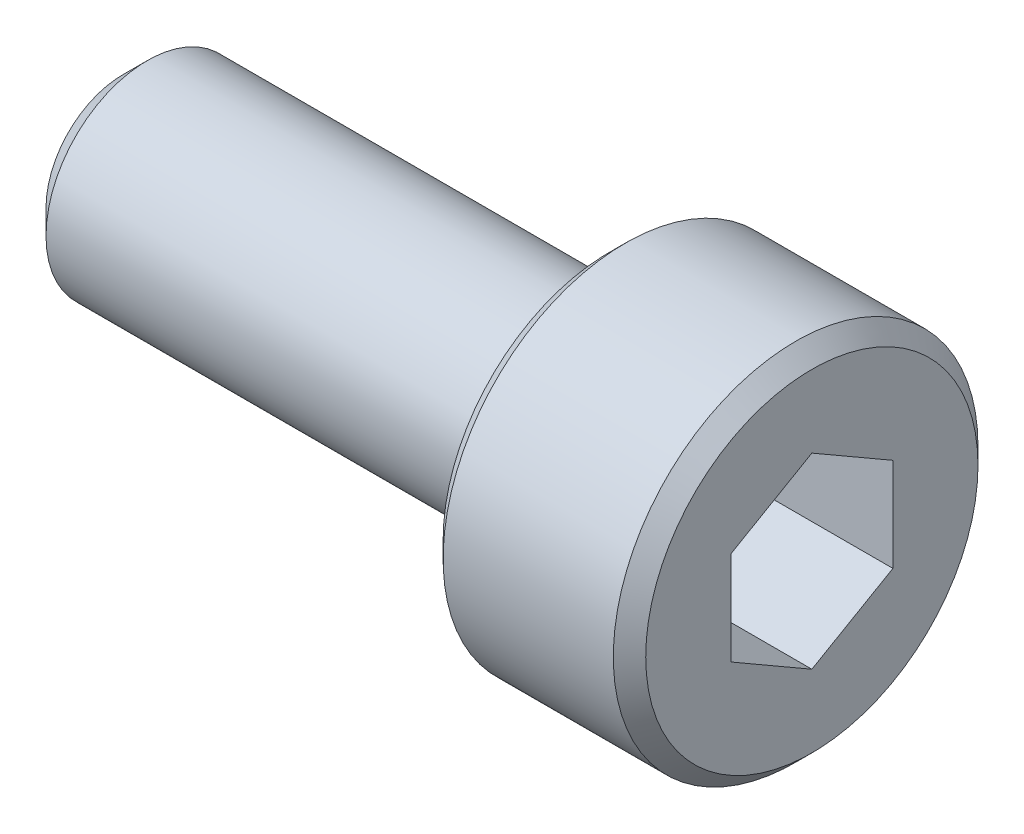
ISO-10303-21;
HEADER;
FILE_DESCRIPTION(('STEP AP214'),'2;1');
FILE_NAME('part.step','',(''),(''),'','','');
FILE_SCHEMA(('AUTOMOTIVE_DESIGN { 1 0 10303 214 1 1 1 1 }'));
ENDSEC;
DATA;
#1=APPLICATION_CONTEXT('core data for automotive mechanical design processes');
#2=APPLICATION_PROTOCOL_DEFINITION('international standard','automotive_design',2000,#1);
#3=PRODUCT_CONTEXT('',#1,'mechanical');
#4=PRODUCT('Part','Part','',(#3));
#5=PRODUCT_RELATED_PRODUCT_CATEGORY('part','',(#4));
#6=PRODUCT_DEFINITION_FORMATION('','',#4);
#7=PRODUCT_DEFINITION_CONTEXT('part definition',#1,'design');
#8=PRODUCT_DEFINITION('design','',#6,#7);
#9=PRODUCT_DEFINITION_SHAPE('','',#8);
#10=(LENGTH_UNIT() NAMED_UNIT(*) SI_UNIT(.MILLI.,.METRE.));
#11=(NAMED_UNIT(*) PLANE_ANGLE_UNIT() SI_UNIT($,.RADIAN.));
#12=(NAMED_UNIT(*) SI_UNIT($,.STERADIAN.) SOLID_ANGLE_UNIT());
#13=UNCERTAINTY_MEASURE_WITH_UNIT(LENGTH_MEASURE(1.E-05),#10,'distance_accuracy_value','');
#14=(GEOMETRIC_REPRESENTATION_CONTEXT(3) GLOBAL_UNCERTAINTY_ASSIGNED_CONTEXT((#13)) GLOBAL_UNIT_ASSIGNED_CONTEXT((#10,
#11,#12)) REPRESENTATION_CONTEXT('',''));
#15=CARTESIAN_POINT('',(0.,0.,0.));
#16=DIRECTION('',(0.,0.,1.));
#17=DIRECTION('',(1.,0.,0.));
#18=AXIS2_PLACEMENT_3D('',#15,#16,#17);
#19=CARTESIAN_POINT('',(0.,0.,1.25));
#20=DIRECTION('',(1.,0.,0.));
#21=DIRECTION('',(0.,0.,-1.));
#22=AXIS2_PLACEMENT_3D('',#19,#20,#21);
#23=CYLINDRICAL_SURFACE('',#22,1.25);
#24=CARTESIAN_POINT('',(-5.7,0.,1.25));
#25=DIRECTION('',(-1.,0.,0.));
#26=DIRECTION('',(0.,0.,1.));
#27=AXIS2_PLACEMENT_3D('',#24,#25,#26);
#28=CIRCLE('',#27,1.25);
#29=CARTESIAN_POINT('',(-5.7,0.,2.5));
#30=VERTEX_POINT('',#29);
#31=EDGE_CURVE('E42',#30,#30,#28,.F.);
#32=ORIENTED_EDGE('',*,*,#31,.T.);
#33=EDGE_LOOP('',(#32));
#34=FACE_BOUND('',#33,.T.);
#35=CARTESIAN_POINT('',(0.,0.,1.25));
#36=DIRECTION('',(1.,0.,0.));
#37=DIRECTION('',(0.,0.,-1.));
#38=AXIS2_PLACEMENT_3D('',#35,#36,#37);
#39=CIRCLE('',#38,1.25);
#40=CARTESIAN_POINT('',(0.,0.,0.));
#41=VERTEX_POINT('',#40);
#42=EDGE_CURVE('E136',#41,#41,#39,.T.);
#43=ORIENTED_EDGE('',*,*,#42,.F.);
#44=EDGE_LOOP('',(#43));
#45=FACE_BOUND('',#44,.T.);
#46=ADVANCED_FACE('F34',(#34,#45),#23,.T.);
#47=CARTESIAN_POINT('',(-6.,0.,0.));
#48=DIRECTION('',(-1.,0.,0.));
#49=DIRECTION('',(0.,0.,1.));
#50=AXIS2_PLACEMENT_3D('',#47,#48,#49);
#51=PLANE('',#50);
#52=CARTESIAN_POINT('',(-6.,0.,1.25));
#53=DIRECTION('',(-1.,0.,0.));
#54=DIRECTION('',(0.,0.,1.));
#55=AXIS2_PLACEMENT_3D('',#52,#53,#54);
#56=CIRCLE('',#55,0.950000000000001);
#57=CARTESIAN_POINT('',(-6.,0.,2.2));
#58=VERTEX_POINT('',#57);
#59=EDGE_CURVE('E11',#58,#58,#56,.T.);
#60=ORIENTED_EDGE('',*,*,#59,.T.);
#61=EDGE_LOOP('',(#60));
#62=FACE_BOUND('',#61,.T.);
#63=ADVANCED_FACE('F170',(#62),#51,.T.);
#64=CARTESIAN_POINT('',(2.5,0.,0.));
#65=DIRECTION('',(1.,0.,0.));
#66=DIRECTION('',(0.,0.,-1.));
#67=AXIS2_PLACEMENT_3D('',#64,#65,#66);
#68=PLANE('',#67);
#69=CARTESIAN_POINT('',(2.5,0.,1.25));
#70=DIRECTION('',(1.,0.,0.));
#71=DIRECTION('',(0.,0.,-1.));
#72=AXIS2_PLACEMENT_3D('',#69,#70,#71);
#73=CIRCLE('',#72,2.05);
#74=CARTESIAN_POINT('',(2.5,0.,-0.799999999999998));
#75=VERTEX_POINT('',#74);
#76=EDGE_CURVE('E153',#75,#75,#73,.T.);
#77=ORIENTED_EDGE('',*,*,#76,.T.);
#78=EDGE_LOOP('',(#77));
#79=FACE_BOUND('',#78,.T.);
#80=DIRECTION('',(0.,0.5,0.866025403784439));
#81=VECTOR('',#80,1.);
#82=CARTESIAN_POINT('',(2.5,0.577350269189626,0.25));
#83=LINE('',#82,#81);
#84=CARTESIAN_POINT('',(2.5,0.577350269189626,0.25));
#85=VERTEX_POINT('',#84);
#86=CARTESIAN_POINT('',(2.5,1.15470053837925,1.25));
#87=VERTEX_POINT('',#86);
#88=EDGE_CURVE('E49',#85,#87,#83,.T.);
#89=ORIENTED_EDGE('',*,*,#88,.F.);
#90=DIRECTION('',(0.,1.,0.));
#91=VECTOR('',#90,1.);
#92=CARTESIAN_POINT('',(2.5,-0.577350269189626,0.25));
#93=LINE('',#92,#91);
#94=CARTESIAN_POINT('',(2.5,-0.577350269189626,0.25));
#95=VERTEX_POINT('',#94);
#96=EDGE_CURVE('E132',#95,#85,#93,.T.);
#97=ORIENTED_EDGE('',*,*,#96,.F.);
#98=DIRECTION('',(0.,0.5,-0.866025403784439));
#99=VECTOR('',#98,1.);
#100=CARTESIAN_POINT('',(2.5,-1.15470053837925,1.25));
#101=LINE('',#100,#99);
#102=CARTESIAN_POINT('',(2.5,-1.15470053837925,1.25));
#103=VERTEX_POINT('',#102);
#104=EDGE_CURVE('E130',#103,#95,#101,.T.);
#105=ORIENTED_EDGE('',*,*,#104,.F.);
#106=DIRECTION('',(0.,-0.5,-0.866025403784439));
#107=VECTOR('',#106,1.);
#108=CARTESIAN_POINT('',(2.5,-0.577350269189626,2.25));
#109=LINE('',#108,#107);
#110=CARTESIAN_POINT('',(2.5,-0.577350269189626,2.25));
#111=VERTEX_POINT('',#110);
#112=EDGE_CURVE('E97',#111,#103,#109,.T.);
#113=ORIENTED_EDGE('',*,*,#112,.F.);
#114=DIRECTION('',(0.,-1.,0.));
#115=VECTOR('',#114,1.);
#116=CARTESIAN_POINT('',(2.5,0.577350269189626,2.25));
#117=LINE('',#116,#115);
#118=CARTESIAN_POINT('',(2.5,0.577350269189626,2.25));
#119=VERTEX_POINT('',#118);
#120=EDGE_CURVE('E126',#119,#111,#117,.T.);
#121=ORIENTED_EDGE('',*,*,#120,.F.);
#122=DIRECTION('',(0.,-0.5,0.866025403784439));
#123=VECTOR('',#122,1.);
#124=CARTESIAN_POINT('',(2.5,1.15470053837925,1.25));
#125=LINE('',#124,#123);
#126=EDGE_CURVE('E123',#87,#119,#125,.T.);
#127=ORIENTED_EDGE('',*,*,#126,.F.);
#128=EDGE_LOOP('',(#89,#97,#105,#113,#121,#127));
#129=FACE_BOUND('',#128,.T.);
#130=ADVANCED_FACE('F175',(#79,#129),#68,.T.);
#131=CARTESIAN_POINT('',(0.,0.,1.25));
#132=DIRECTION('',(1.,0.,0.));
#133=DIRECTION('',(0.,0.,-1.));
#134=AXIS2_PLACEMENT_3D('',#131,#132,#133);
#135=CYLINDRICAL_SURFACE('',#134,2.25);
#136=CARTESIAN_POINT('',(0.2,0.,1.25));
#137=DIRECTION('',(1.,0.,0.));
#138=DIRECTION('',(0.,0.,-1.));
#139=AXIS2_PLACEMENT_3D('',#136,#137,#138);
#140=CIRCLE('',#139,2.25);
#141=CARTESIAN_POINT('',(0.2,0.,-1.));
#142=VERTEX_POINT('',#141);
#143=EDGE_CURVE('E147',#142,#142,#140,.T.);
#144=ORIENTED_EDGE('',*,*,#143,.T.);
#145=EDGE_LOOP('',(#144));
#146=FACE_BOUND('',#145,.T.);
#147=CARTESIAN_POINT('',(2.3,0.,1.25));
#148=DIRECTION('',(1.,0.,0.));
#149=DIRECTION('',(0.,0.,-1.));
#150=AXIS2_PLACEMENT_3D('',#147,#148,#149);
#151=CIRCLE('',#150,2.25);
#152=CARTESIAN_POINT('',(2.3,0.,-1.));
#153=VERTEX_POINT('',#152);
#154=EDGE_CURVE('E144',#153,#153,#151,.F.);
#155=ORIENTED_EDGE('',*,*,#154,.T.);
#156=EDGE_LOOP('',(#155));
#157=FACE_BOUND('',#156,.T.);
#158=ADVANCED_FACE('F191',(#146,#157),#135,.T.);
#159=CARTESIAN_POINT('',(0.,0.,0.));
#160=DIRECTION('',(1.,0.,0.));
#161=DIRECTION('',(0.,0.,-1.));
#162=AXIS2_PLACEMENT_3D('',#159,#160,#161);
#163=PLANE('',#162);
#164=CARTESIAN_POINT('',(0.,0.,1.25));
#165=DIRECTION('',(1.,0.,0.));
#166=DIRECTION('',(0.,0.,-1.));
#167=AXIS2_PLACEMENT_3D('',#164,#165,#166);
#168=CIRCLE('',#167,2.05);
#169=CARTESIAN_POINT('',(0.,0.,-0.8));
#170=VERTEX_POINT('',#169);
#171=EDGE_CURVE('E150',#170,#170,#168,.F.);
#172=ORIENTED_EDGE('',*,*,#171,.T.);
#173=EDGE_LOOP('',(#172));
#174=FACE_BOUND('',#173,.T.);
#175=ORIENTED_EDGE('',*,*,#42,.T.);
#176=EDGE_LOOP('',(#175));
#177=FACE_BOUND('',#176,.T.);
#178=ADVANCED_FACE('F194',(#174,#177),#163,.F.);
#179=CARTESIAN_POINT('',(0.5,0.577350269189626,0.250000000000001));
#180=DIRECTION('',(0.,0.866025403784439,-0.5));
#181=DIRECTION('',(0.,0.5,0.866025403784439));
#182=AXIS2_PLACEMENT_3D('',#179,#180,#181);
#183=PLANE('',#182);
#184=ORIENTED_EDGE('',*,*,#88,.T.);
#185=DIRECTION('',(1.,0.,0.));
#186=VECTOR('',#185,1.);
#187=CARTESIAN_POINT('',(0.5,1.15470053837925,1.25));
#188=LINE('',#187,#186);
#189=CARTESIAN_POINT('',(0.5,1.15470053837925,1.25));
#190=VERTEX_POINT('',#189);
#191=EDGE_CURVE('E79',#190,#87,#188,.T.);
#192=ORIENTED_EDGE('',*,*,#191,.F.);
#193=DIRECTION('',(0.,0.5,0.866025403784439));
#194=VECTOR('',#193,1.);
#195=CARTESIAN_POINT('',(0.5,0.577350269189626,0.250000000000001));
#196=LINE('',#195,#194);
#197=CARTESIAN_POINT('',(0.5,0.577350269189626,0.250000000000001));
#198=VERTEX_POINT('',#197);
#199=EDGE_CURVE('E134',#198,#190,#196,.T.);
#200=ORIENTED_EDGE('',*,*,#199,.F.);
#201=DIRECTION('',(1.,0.,0.));
#202=VECTOR('',#201,1.);
#203=CARTESIAN_POINT('',(0.5,0.577350269189626,0.250000000000001));
#204=LINE('',#203,#202);
#205=EDGE_CURVE('E57',#198,#85,#204,.T.);
#206=ORIENTED_EDGE('',*,*,#205,.T.);
#207=EDGE_LOOP('',(#184,#192,#200,#206));
#208=FACE_BOUND('',#207,.T.);
#209=ADVANCED_FACE('F207',(#208),#183,.F.);
#210=CARTESIAN_POINT('',(0.5,-0.577350269189626,0.25));
#211=DIRECTION('',(0.,0.,-1.));
#212=DIRECTION('',(0.,1.,0.));
#213=AXIS2_PLACEMENT_3D('',#210,#211,#212);
#214=PLANE('',#213);
#215=ORIENTED_EDGE('',*,*,#96,.T.);
#216=ORIENTED_EDGE('',*,*,#205,.F.);
#217=DIRECTION('',(0.,1.,0.));
#218=VECTOR('',#217,1.);
#219=CARTESIAN_POINT('',(0.5,-0.577350269189626,0.25));
#220=LINE('',#219,#218);
#221=CARTESIAN_POINT('',(0.5,-0.577350269189626,0.25));
#222=VERTEX_POINT('',#221);
#223=EDGE_CURVE('E109',#222,#198,#220,.T.);
#224=ORIENTED_EDGE('',*,*,#223,.F.);
#225=DIRECTION('',(1.,0.,0.));
#226=VECTOR('',#225,1.);
#227=CARTESIAN_POINT('',(0.5,-0.577350269189626,0.25));
#228=LINE('',#227,#226);
#229=EDGE_CURVE('E101',#222,#95,#228,.T.);
#230=ORIENTED_EDGE('',*,*,#229,.T.);
#231=EDGE_LOOP('',(#215,#216,#224,#230));
#232=FACE_BOUND('',#231,.T.);
#233=ADVANCED_FACE('F209',(#232),#214,.F.);
#234=CARTESIAN_POINT('',(0.5,-1.15470053837925,1.25));
#235=DIRECTION('',(0.,-0.866025403784439,-0.5));
#236=DIRECTION('',(0.,0.5,-0.866025403784439));
#237=AXIS2_PLACEMENT_3D('',#234,#235,#236);
#238=PLANE('',#237);
#239=ORIENTED_EDGE('',*,*,#104,.T.);
#240=ORIENTED_EDGE('',*,*,#229,.F.);
#241=DIRECTION('',(0.,0.5,-0.866025403784439));
#242=VECTOR('',#241,1.);
#243=CARTESIAN_POINT('',(0.5,-1.15470053837925,1.25));
#244=LINE('',#243,#242);
#245=CARTESIAN_POINT('',(0.5,-1.15470053837925,1.25));
#246=VERTEX_POINT('',#245);
#247=EDGE_CURVE('E105',#246,#222,#244,.T.);
#248=ORIENTED_EDGE('',*,*,#247,.F.);
#249=DIRECTION('',(1.,0.,0.));
#250=VECTOR('',#249,1.);
#251=CARTESIAN_POINT('',(0.5,-1.15470053837925,1.25));
#252=LINE('',#251,#250);
#253=EDGE_CURVE('E90',#246,#103,#252,.T.);
#254=ORIENTED_EDGE('',*,*,#253,.T.);
#255=EDGE_LOOP('',(#239,#240,#248,#254));
#256=FACE_BOUND('',#255,.T.);
#257=ADVANCED_FACE('F106',(#256),#238,.F.);
#258=CARTESIAN_POINT('',(0.500000000000001,-0.577350269189626,2.25));
#259=DIRECTION('',(0.,-0.866025403784439,0.5));
#260=DIRECTION('',(0.,-0.5,-0.866025403784439));
#261=AXIS2_PLACEMENT_3D('',#258,#259,#260);
#262=PLANE('',#261);
#263=ORIENTED_EDGE('',*,*,#112,.T.);
#264=ORIENTED_EDGE('',*,*,#253,.F.);
#265=DIRECTION('',(0.,-0.5,-0.866025403784439));
#266=VECTOR('',#265,1.);
#267=CARTESIAN_POINT('',(0.500000000000001,-0.577350269189626,2.25));
#268=LINE('',#267,#266);
#269=CARTESIAN_POINT('',(0.500000000000001,-0.577350269189626,2.25));
#270=VERTEX_POINT('',#269);
#271=EDGE_CURVE('E94',#270,#246,#268,.T.);
#272=ORIENTED_EDGE('',*,*,#271,.F.);
#273=DIRECTION('',(1.,0.,0.));
#274=VECTOR('',#273,1.);
#275=CARTESIAN_POINT('',(0.500000000000001,-0.577350269189626,2.25));
#276=LINE('',#275,#274);
#277=EDGE_CURVE('E102',#270,#111,#276,.T.);
#278=ORIENTED_EDGE('',*,*,#277,.T.);
#279=EDGE_LOOP('',(#263,#264,#272,#278));
#280=FACE_BOUND('',#279,.T.);
#281=ADVANCED_FACE('F92',(#280),#262,.F.);
#282=CARTESIAN_POINT('',(0.500000000000001,0.577350269189626,2.25));
#283=DIRECTION('',(0.,0.,1.));
#284=DIRECTION('',(1.,0.,0.));
#285=AXIS2_PLACEMENT_3D('',#282,#283,#284);
#286=PLANE('',#285);
#287=ORIENTED_EDGE('',*,*,#120,.T.);
#288=ORIENTED_EDGE('',*,*,#277,.F.);
#289=DIRECTION('',(0.,-1.,0.));
#290=VECTOR('',#289,1.);
#291=CARTESIAN_POINT('',(0.500000000000001,0.577350269189626,2.25));
#292=LINE('',#291,#290);
#293=CARTESIAN_POINT('',(0.500000000000001,0.577350269189626,2.25));
#294=VERTEX_POINT('',#293);
#295=EDGE_CURVE('E115',#294,#270,#292,.T.);
#296=ORIENTED_EDGE('',*,*,#295,.F.);
#297=DIRECTION('',(1.,0.,0.));
#298=VECTOR('',#297,1.);
#299=CARTESIAN_POINT('',(0.500000000000001,0.577350269189626,2.25));
#300=LINE('',#299,#298);
#301=EDGE_CURVE('E139',#294,#119,#300,.T.);
#302=ORIENTED_EDGE('',*,*,#301,.T.);
#303=EDGE_LOOP('',(#287,#288,#296,#302));
#304=FACE_BOUND('',#303,.T.);
#305=ADVANCED_FACE('F221',(#304),#286,.F.);
#306=CARTESIAN_POINT('',(0.5,1.15470053837925,1.25));
#307=DIRECTION('',(0.,0.866025403784439,0.5));
#308=DIRECTION('',(0.,-0.5,0.866025403784439));
#309=AXIS2_PLACEMENT_3D('',#306,#307,#308);
#310=PLANE('',#309);
#311=ORIENTED_EDGE('',*,*,#126,.T.);
#312=ORIENTED_EDGE('',*,*,#301,.F.);
#313=DIRECTION('',(0.,-0.5,0.866025403784439));
#314=VECTOR('',#313,1.);
#315=CARTESIAN_POINT('',(0.5,1.15470053837925,1.25));
#316=LINE('',#315,#314);
#317=EDGE_CURVE('E117',#190,#294,#316,.T.);
#318=ORIENTED_EDGE('',*,*,#317,.F.);
#319=ORIENTED_EDGE('',*,*,#191,.T.);
#320=EDGE_LOOP('',(#311,#312,#318,#319));
#321=FACE_BOUND('',#320,.T.);
#322=ADVANCED_FACE('F185',(#321),#310,.F.);
#323=CARTESIAN_POINT('',(0.5,0.,0.));
#324=DIRECTION('',(1.,0.,0.));
#325=DIRECTION('',(0.,1.,0.));
#326=AXIS2_PLACEMENT_3D('',#323,#324,#325);
#327=PLANE('',#326);
#328=ORIENTED_EDGE('',*,*,#199,.T.);
#329=ORIENTED_EDGE('',*,*,#317,.T.);
#330=ORIENTED_EDGE('',*,*,#295,.T.);
#331=ORIENTED_EDGE('',*,*,#271,.T.);
#332=ORIENTED_EDGE('',*,*,#247,.T.);
#333=ORIENTED_EDGE('',*,*,#223,.T.);
#334=EDGE_LOOP('',(#328,#329,#330,#331,#332,#333));
#335=FACE_BOUND('',#334,.T.);
#336=ADVANCED_FACE('F112',(#335),#327,.T.);
#337=CARTESIAN_POINT('',(0.2,0.,1.25));
#338=DIRECTION('',(1.,0.,0.));
#339=DIRECTION('',(0.,0.,-1.));
#340=AXIS2_PLACEMENT_3D('',#337,#338,#339);
#341=CONICAL_SURFACE('',#340,2.25,0.785398163397448);
#342=ORIENTED_EDGE('',*,*,#171,.F.);
#343=EDGE_LOOP('',(#342));
#344=FACE_BOUND('',#343,.T.);
#345=ORIENTED_EDGE('',*,*,#143,.F.);
#346=EDGE_LOOP('',(#345));
#347=FACE_BOUND('',#346,.T.);
#348=ADVANCED_FACE('F166',(#344,#347),#341,.T.);
#349=CARTESIAN_POINT('',(2.5,0.,1.25));
#350=DIRECTION('',(-1.,0.,0.));
#351=DIRECTION('',(0.,0.,1.));
#352=AXIS2_PLACEMENT_3D('',#349,#350,#351);
#353=CONICAL_SURFACE('',#352,2.05,0.785398163397446);
#354=ORIENTED_EDGE('',*,*,#154,.F.);
#355=EDGE_LOOP('',(#354));
#356=FACE_BOUND('',#355,.T.);
#357=ORIENTED_EDGE('',*,*,#76,.F.);
#358=EDGE_LOOP('',(#357));
#359=FACE_BOUND('',#358,.T.);
#360=ADVANCED_FACE('F161',(#356,#359),#353,.T.);
#361=CARTESIAN_POINT('',(-5.7,0.,1.25));
#362=DIRECTION('',(1.,0.,0.));
#363=DIRECTION('',(0.,0.,-1.));
#364=AXIS2_PLACEMENT_3D('',#361,#362,#363);
#365=CONICAL_SURFACE('',#364,1.25,0.78539816339745);
#366=ORIENTED_EDGE('',*,*,#59,.F.);
#367=EDGE_LOOP('',(#366));
#368=FACE_BOUND('',#367,.T.);
#369=ORIENTED_EDGE('',*,*,#31,.F.);
#370=EDGE_LOOP('',(#369));
#371=FACE_BOUND('',#370,.T.);
#372=ADVANCED_FACE('F36',(#368,#371),#365,.T.);
#373=CLOSED_SHELL('',(#46,#63,#130,#158,#178,#209,#233,#257,#281,#305,#322,#336,#348,#360,#372));
#374=MANIFOLD_SOLID_BREP('B2',#373);
#375=ADVANCED_BREP_SHAPE_REPRESENTATION('',(#18,#374),#14);
#376=SHAPE_DEFINITION_REPRESENTATION(#9,#375);
ENDSEC;
END-ISO-10303-21;
